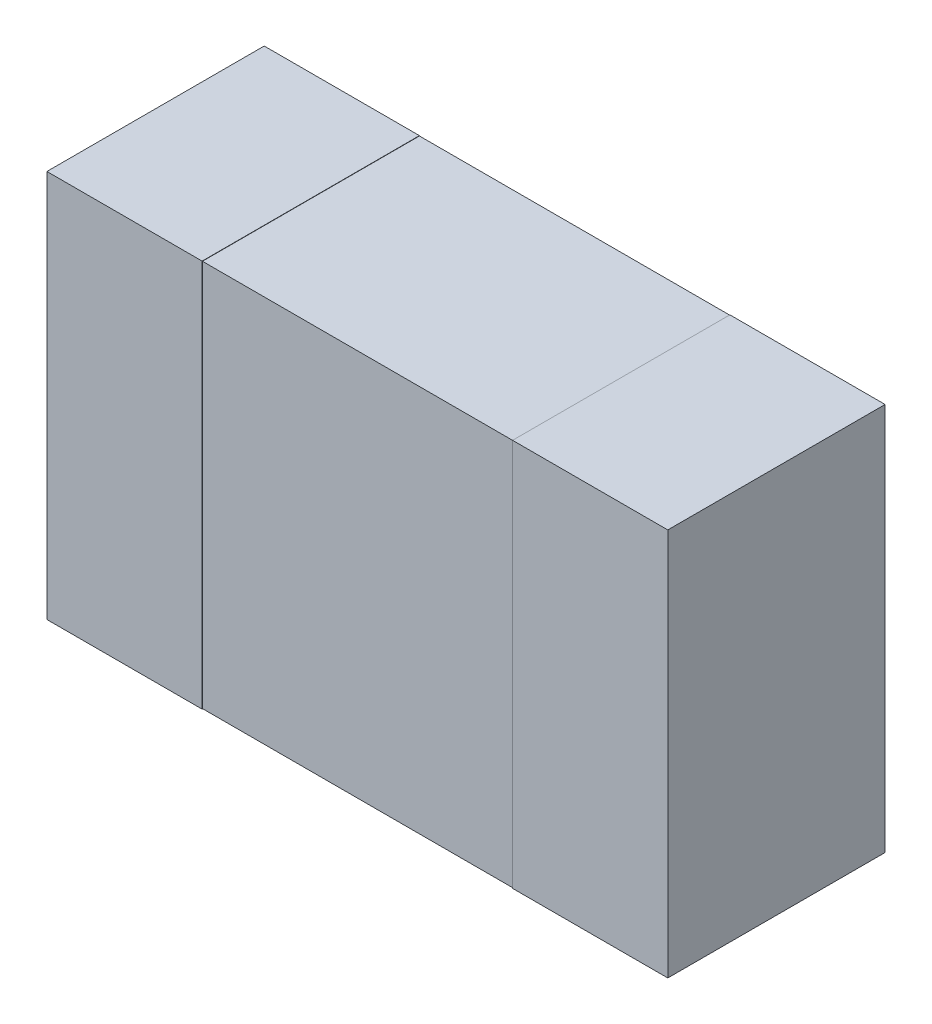
ISO-10303-21;
HEADER;
FILE_DESCRIPTION(('STEP AP214'),'2;1');
FILE_NAME('part.step','',(''),(''),'','','');
FILE_SCHEMA(('AUTOMOTIVE_DESIGN { 1 0 10303 214 1 1 1 1 }'));
ENDSEC;
DATA;
#1=APPLICATION_CONTEXT('core data for automotive mechanical design processes');
#2=APPLICATION_PROTOCOL_DEFINITION('international standard','automotive_design',2000,#1);
#3=PRODUCT_CONTEXT('',#1,'mechanical');
#4=PRODUCT('Part','Part','',(#3));
#5=PRODUCT_RELATED_PRODUCT_CATEGORY('part','',(#4));
#6=PRODUCT_DEFINITION_FORMATION('','',#4);
#7=PRODUCT_DEFINITION_CONTEXT('part definition',#1,'design');
#8=PRODUCT_DEFINITION('design','',#6,#7);
#9=PRODUCT_DEFINITION_SHAPE('','',#8);
#10=(LENGTH_UNIT() NAMED_UNIT(*) SI_UNIT(.MILLI.,.METRE.));
#11=(NAMED_UNIT(*) PLANE_ANGLE_UNIT() SI_UNIT($,.RADIAN.));
#12=(NAMED_UNIT(*) SI_UNIT($,.STERADIAN.) SOLID_ANGLE_UNIT());
#13=UNCERTAINTY_MEASURE_WITH_UNIT(LENGTH_MEASURE(1.E-05),#10,'distance_accuracy_value','');
#14=(GEOMETRIC_REPRESENTATION_CONTEXT(3) GLOBAL_UNCERTAINTY_ASSIGNED_CONTEXT((#13)) GLOBAL_UNIT_ASSIGNED_CONTEXT((#10,
#11,#12)) REPRESENTATION_CONTEXT('',''));
#15=CARTESIAN_POINT('',(0.,0.,0.));
#16=DIRECTION('',(0.,0.,1.));
#17=DIRECTION('',(1.,0.,0.));
#18=AXIS2_PLACEMENT_3D('',#15,#16,#17);
#19=CARTESIAN_POINT('',(0.5,-0.625,0.699));
#20=DIRECTION('',(0.,0.,-1.));
#21=DIRECTION('',(-1.,0.,0.));
#22=AXIS2_PLACEMENT_3D('',#19,#20,#21);
#23=PLANE('',#22);
#24=DIRECTION('',(0.,1.,0.));
#25=VECTOR('',#24,1.);
#26=CARTESIAN_POINT('',(0.5,-0.625,0.699));
#27=LINE('',#26,#25);
#28=CARTESIAN_POINT('',(0.5,-0.624,0.699));
#29=VERTEX_POINT('',#28);
#30=CARTESIAN_POINT('',(0.5,0.624,0.699));
#31=VERTEX_POINT('',#30);
#32=EDGE_CURVE('E197',#29,#31,#27,.T.);
#33=ORIENTED_EDGE('',*,*,#32,.T.);
#34=DIRECTION('',(-1.,0.,0.));
#35=VECTOR('',#34,1.);
#36=CARTESIAN_POINT('',(0.5,0.624,0.699));
#37=LINE('',#36,#35);
#38=CARTESIAN_POINT('',(-0.5,0.624,0.699));
#39=VERTEX_POINT('',#38);
#40=EDGE_CURVE('E242',#31,#39,#37,.T.);
#41=ORIENTED_EDGE('',*,*,#40,.T.);
#42=DIRECTION('',(0.,1.,0.));
#43=VECTOR('',#42,1.);
#44=CARTESIAN_POINT('',(-0.5,-0.625,0.699));
#45=LINE('',#44,#43);
#46=CARTESIAN_POINT('',(-0.5,-0.624,0.699));
#47=VERTEX_POINT('',#46);
#48=EDGE_CURVE('E193',#47,#39,#45,.T.);
#49=ORIENTED_EDGE('',*,*,#48,.F.);
#50=DIRECTION('',(-1.,0.,0.));
#51=VECTOR('',#50,1.);
#52=CARTESIAN_POINT('',(0.5,-0.624,0.699));
#53=LINE('',#52,#51);
#54=EDGE_CURVE('E11',#29,#47,#53,.T.);
#55=ORIENTED_EDGE('',*,*,#54,.F.);
#56=EDGE_LOOP('',(#33,#41,#49,#55));
#57=FACE_BOUND('',#56,.T.);
#58=ADVANCED_FACE('F18',(#57),#23,.F.);
#59=CARTESIAN_POINT('',(0.5,-0.624,0.7));
#60=DIRECTION('',(0.,1.,0.));
#61=DIRECTION('',(1.,0.,0.));
#62=AXIS2_PLACEMENT_3D('',#59,#60,#61);
#63=PLANE('',#62);
#64=DIRECTION('',(0.,0.,-1.));
#65=VECTOR('',#64,1.);
#66=CARTESIAN_POINT('',(0.5,-0.624,0.7));
#67=LINE('',#66,#65);
#68=CARTESIAN_POINT('',(0.5,-0.624,0.));
#69=VERTEX_POINT('',#68);
#70=EDGE_CURVE('E28',#29,#69,#67,.T.);
#71=ORIENTED_EDGE('',*,*,#70,.F.);
#72=ORIENTED_EDGE('',*,*,#54,.T.);
#73=DIRECTION('',(0.,0.,-1.));
#74=VECTOR('',#73,1.);
#75=CARTESIAN_POINT('',(-0.5,-0.624,0.7));
#76=LINE('',#75,#74);
#77=CARTESIAN_POINT('',(-0.5,-0.624,0.));
#78=VERTEX_POINT('',#77);
#79=EDGE_CURVE('E196',#47,#78,#76,.T.);
#80=ORIENTED_EDGE('',*,*,#79,.T.);
#81=DIRECTION('',(1.,0.,0.));
#82=VECTOR('',#81,1.);
#83=CARTESIAN_POINT('',(0.5,-0.624,0.));
#84=LINE('',#83,#82);
#85=EDGE_CURVE('E222',#78,#69,#84,.T.);
#86=ORIENTED_EDGE('',*,*,#85,.T.);
#87=EDGE_LOOP('',(#71,#72,#80,#86));
#88=FACE_BOUND('',#87,.T.);
#89=ADVANCED_FACE('F280',(#88),#63,.F.);
#90=CARTESIAN_POINT('',(0.5,0.625,0.7));
#91=DIRECTION('',(1.,-1.084202172485E-13,0.));
#92=DIRECTION('',(-1.084202172485E-13,-1.,0.));
#93=AXIS2_PLACEMENT_3D('',#90,#91,#92);
#94=PLANE('',#93);
#95=DIRECTION('',(-1.084202172485E-13,-1.,0.));
#96=VECTOR('',#95,1.);
#97=CARTESIAN_POINT('',(0.5,0.625,0.));
#98=LINE('',#97,#96);
#99=CARTESIAN_POINT('',(0.5,0.625,0.));
#100=VERTEX_POINT('',#99);
#101=CARTESIAN_POINT('',(0.5,0.624,0.));
#102=VERTEX_POINT('',#101);
#103=EDGE_CURVE('E204',#100,#102,#98,.T.);
#104=ORIENTED_EDGE('',*,*,#103,.T.);
#105=DIRECTION('',(0.,0.,-1.));
#106=VECTOR('',#105,1.);
#107=CARTESIAN_POINT('',(0.5,0.624,0.7));
#108=LINE('',#107,#106);
#109=EDGE_CURVE('E200',#31,#102,#108,.T.);
#110=ORIENTED_EDGE('',*,*,#109,.F.);
#111=ORIENTED_EDGE('',*,*,#32,.F.);
#112=ORIENTED_EDGE('',*,*,#70,.T.);
#113=DIRECTION('',(0.,-1.,0.));
#114=VECTOR('',#113,1.);
#115=CARTESIAN_POINT('',(0.5,-0.624,0.));
#116=LINE('',#115,#114);
#117=CARTESIAN_POINT('',(0.5,-0.625,0.));
#118=VERTEX_POINT('',#117);
#119=EDGE_CURVE('E201',#69,#118,#116,.T.);
#120=ORIENTED_EDGE('',*,*,#119,.T.);
#121=DIRECTION('',(0.,0.,-1.));
#122=VECTOR('',#121,1.);
#123=CARTESIAN_POINT('',(0.5,-0.625,0.7));
#124=LINE('',#123,#122);
#125=CARTESIAN_POINT('',(0.5,-0.625,0.7));
#126=VERTEX_POINT('',#125);
#127=EDGE_CURVE('E250',#126,#118,#124,.T.);
#128=ORIENTED_EDGE('',*,*,#127,.F.);
#129=DIRECTION('',(-1.084202172485E-13,-1.,0.));
#130=VECTOR('',#129,1.);
#131=CARTESIAN_POINT('',(0.5,0.625,0.7));
#132=LINE('',#131,#130);
#133=CARTESIAN_POINT('',(0.5,0.625,0.7));
#134=VERTEX_POINT('',#133);
#135=EDGE_CURVE('E226',#134,#126,#132,.T.);
#136=ORIENTED_EDGE('',*,*,#135,.F.);
#137=DIRECTION('',(0.,0.,-1.));
#138=VECTOR('',#137,1.);
#139=CARTESIAN_POINT('',(0.5,0.625,0.7));
#140=LINE('',#139,#138);
#141=EDGE_CURVE('E214',#134,#100,#140,.T.);
#142=ORIENTED_EDGE('',*,*,#141,.T.);
#143=EDGE_LOOP('',(#104,#110,#111,#112,#120,#128,#136,#142));
#144=FACE_BOUND('',#143,.T.);
#145=ADVANCED_FACE('F283',(#144),#94,.F.);
#146=CARTESIAN_POINT('',(0.5,0.624,0.7));
#147=DIRECTION('',(0.,-1.,0.));
#148=DIRECTION('',(0.,0.,-1.));
#149=AXIS2_PLACEMENT_3D('',#146,#147,#148);
#150=PLANE('',#149);
#151=DIRECTION('',(0.,0.,-1.));
#152=VECTOR('',#151,1.);
#153=CARTESIAN_POINT('',(-0.5,0.624,0.7));
#154=LINE('',#153,#152);
#155=CARTESIAN_POINT('',(-0.5,0.624,0.));
#156=VERTEX_POINT('',#155);
#157=EDGE_CURVE('E101',#39,#156,#154,.T.);
#158=ORIENTED_EDGE('',*,*,#157,.F.);
#159=ORIENTED_EDGE('',*,*,#40,.F.);
#160=ORIENTED_EDGE('',*,*,#109,.T.);
#161=DIRECTION('',(-1.,0.,0.));
#162=VECTOR('',#161,1.);
#163=CARTESIAN_POINT('',(0.5,0.624,0.));
#164=LINE('',#163,#162);
#165=EDGE_CURVE('E246',#102,#156,#164,.T.);
#166=ORIENTED_EDGE('',*,*,#165,.T.);
#167=EDGE_LOOP('',(#158,#159,#160,#166));
#168=FACE_BOUND('',#167,.T.);
#169=ADVANCED_FACE('F291',(#168),#150,.F.);
#170=CARTESIAN_POINT('',(-0.5,0.625,0.7));
#171=DIRECTION('',(-1.,-1.084202172485E-13,0.));
#172=DIRECTION('',(-1.084202172485E-13,1.,0.));
#173=AXIS2_PLACEMENT_3D('',#170,#171,#172);
#174=PLANE('',#173);
#175=DIRECTION('',(-1.084202172485E-13,1.,0.));
#176=VECTOR('',#175,1.);
#177=CARTESIAN_POINT('',(-0.5,0.625,0.));
#178=LINE('',#177,#176);
#179=CARTESIAN_POINT('',(-0.5,0.625,0.));
#180=VERTEX_POINT('',#179);
#181=EDGE_CURVE('E187',#156,#180,#178,.T.);
#182=ORIENTED_EDGE('',*,*,#181,.T.);
#183=DIRECTION('',(0.,0.,-1.));
#184=VECTOR('',#183,1.);
#185=CARTESIAN_POINT('',(-0.5,0.625,0.7));
#186=LINE('',#185,#184);
#187=CARTESIAN_POINT('',(-0.5,0.625,0.7));
#188=VERTEX_POINT('',#187);
#189=EDGE_CURVE('E169',#188,#180,#186,.T.);
#190=ORIENTED_EDGE('',*,*,#189,.F.);
#191=DIRECTION('',(-1.084202172485E-13,1.,0.));
#192=VECTOR('',#191,1.);
#193=CARTESIAN_POINT('',(-0.5,0.625,0.7));
#194=LINE('',#193,#192);
#195=CARTESIAN_POINT('',(-0.5,-0.625,0.7));
#196=VERTEX_POINT('',#195);
#197=EDGE_CURVE('E166',#196,#188,#194,.T.);
#198=ORIENTED_EDGE('',*,*,#197,.F.);
#199=DIRECTION('',(0.,0.,-1.));
#200=VECTOR('',#199,1.);
#201=CARTESIAN_POINT('',(-0.5,-0.625,0.7));
#202=LINE('',#201,#200);
#203=CARTESIAN_POINT('',(-0.5,-0.625,0.));
#204=VERTEX_POINT('',#203);
#205=EDGE_CURVE('E154',#196,#204,#202,.T.);
#206=ORIENTED_EDGE('',*,*,#205,.T.);
#207=DIRECTION('',(0.,1.,0.));
#208=VECTOR('',#207,1.);
#209=CARTESIAN_POINT('',(-0.5,-0.624,0.));
#210=LINE('',#209,#208);
#211=EDGE_CURVE('E225',#204,#78,#210,.T.);
#212=ORIENTED_EDGE('',*,*,#211,.T.);
#213=ORIENTED_EDGE('',*,*,#79,.F.);
#214=ORIENTED_EDGE('',*,*,#48,.T.);
#215=ORIENTED_EDGE('',*,*,#157,.T.);
#216=EDGE_LOOP('',(#182,#190,#198,#206,#212,#213,#214,#215));
#217=FACE_BOUND('',#216,.T.);
#218=ADVANCED_FACE('F167',(#217),#174,.F.);
#219=CARTESIAN_POINT('',(0.,0.,0.));
#220=DIRECTION('',(0.,0.,1.));
#221=DIRECTION('',(1.,0.,0.));
#222=AXIS2_PLACEMENT_3D('',#219,#220,#221);
#223=PLANE('',#222);
#224=ORIENTED_EDGE('',*,*,#85,.F.);
#225=ORIENTED_EDGE('',*,*,#211,.F.);
#226=DIRECTION('',(1.,0.,0.));
#227=VECTOR('',#226,1.);
#228=CARTESIAN_POINT('',(-1.,-0.625,0.));
#229=LINE('',#228,#227);
#230=CARTESIAN_POINT('',(-1.,-0.625,0.));
#231=VERTEX_POINT('',#230);
#232=EDGE_CURVE('E160',#231,#204,#229,.T.);
#233=ORIENTED_EDGE('',*,*,#232,.F.);
#234=DIRECTION('',(0.,-1.,0.));
#235=VECTOR('',#234,1.);
#236=CARTESIAN_POINT('',(-1.,0.625,0.));
#237=LINE('',#236,#235);
#238=CARTESIAN_POINT('',(-1.,0.625,0.));
#239=VERTEX_POINT('',#238);
#240=EDGE_CURVE('E126',#239,#231,#237,.T.);
#241=ORIENTED_EDGE('',*,*,#240,.F.);
#242=DIRECTION('',(-1.,0.,0.));
#243=VECTOR('',#242,1.);
#244=CARTESIAN_POINT('',(-1.,0.625,0.));
#245=LINE('',#244,#243);
#246=EDGE_CURVE('E21',#180,#239,#245,.T.);
#247=ORIENTED_EDGE('',*,*,#246,.F.);
#248=ORIENTED_EDGE('',*,*,#181,.F.);
#249=ORIENTED_EDGE('',*,*,#165,.F.);
#250=ORIENTED_EDGE('',*,*,#103,.F.);
#251=DIRECTION('',(-1.,0.,0.));
#252=VECTOR('',#251,1.);
#253=CARTESIAN_POINT('',(-1.,0.625,0.));
#254=LINE('',#253,#252);
#255=CARTESIAN_POINT('',(1.,0.625,0.));
#256=VERTEX_POINT('',#255);
#257=EDGE_CURVE('E218',#256,#100,#254,.T.);
#258=ORIENTED_EDGE('',*,*,#257,.F.);
#259=DIRECTION('',(0.,1.,0.));
#260=VECTOR('',#259,1.);
#261=CARTESIAN_POINT('',(1.,0.625,0.));
#262=LINE('',#261,#260);
#263=CARTESIAN_POINT('',(1.,-0.625,0.));
#264=VERTEX_POINT('',#263);
#265=EDGE_CURVE('E205',#264,#256,#262,.T.);
#266=ORIENTED_EDGE('',*,*,#265,.F.);
#267=DIRECTION('',(1.,0.,0.));
#268=VECTOR('',#267,1.);
#269=CARTESIAN_POINT('',(-1.,-0.625,0.));
#270=LINE('',#269,#268);
#271=EDGE_CURVE('E116',#118,#264,#270,.T.);
#272=ORIENTED_EDGE('',*,*,#271,.F.);
#273=ORIENTED_EDGE('',*,*,#119,.F.);
#274=EDGE_LOOP('',(#224,#225,#233,#241,#247,#248,#249,#250,#258,#266,#272,#273));
#275=FACE_BOUND('',#274,.T.);
#276=ADVANCED_FACE('F326',(#275),#223,.F.);
#277=CARTESIAN_POINT('',(0.,0.,0.7));
#278=DIRECTION('',(0.,0.,1.));
#279=DIRECTION('',(1.,0.,0.));
#280=AXIS2_PLACEMENT_3D('',#277,#278,#279);
#281=PLANE('',#280);
#282=ORIENTED_EDGE('',*,*,#135,.T.);
#283=DIRECTION('',(1.,0.,0.));
#284=VECTOR('',#283,1.);
#285=CARTESIAN_POINT('',(-1.,-0.625,0.7));
#286=LINE('',#285,#284);
#287=CARTESIAN_POINT('',(1.,-0.625,0.7));
#288=VERTEX_POINT('',#287);
#289=EDGE_CURVE('E191',#126,#288,#286,.T.);
#290=ORIENTED_EDGE('',*,*,#289,.T.);
#291=DIRECTION('',(0.,1.,0.));
#292=VECTOR('',#291,1.);
#293=CARTESIAN_POINT('',(1.,0.625,0.7));
#294=LINE('',#293,#292);
#295=CARTESIAN_POINT('',(1.,0.625,0.7));
#296=VERTEX_POINT('',#295);
#297=EDGE_CURVE('E219',#288,#296,#294,.T.);
#298=ORIENTED_EDGE('',*,*,#297,.T.);
#299=DIRECTION('',(-1.,0.,0.));
#300=VECTOR('',#299,1.);
#301=CARTESIAN_POINT('',(-1.,0.625,0.7));
#302=LINE('',#301,#300);
#303=EDGE_CURVE('E192',#296,#134,#302,.T.);
#304=ORIENTED_EDGE('',*,*,#303,.T.);
#305=EDGE_LOOP('',(#282,#290,#298,#304));
#306=FACE_BOUND('',#305,.T.);
#307=ADVANCED_FACE('F275',(#306),#281,.T.);
#308=CARTESIAN_POINT('',(-1.,-0.625,0.7));
#309=DIRECTION('',(0.,1.,0.));
#310=DIRECTION('',(1.,0.,0.));
#311=AXIS2_PLACEMENT_3D('',#308,#309,#310);
#312=PLANE('',#311);
#313=ORIENTED_EDGE('',*,*,#289,.F.);
#314=ORIENTED_EDGE('',*,*,#127,.T.);
#315=ORIENTED_EDGE('',*,*,#271,.T.);
#316=DIRECTION('',(0.,0.,-1.));
#317=VECTOR('',#316,1.);
#318=CARTESIAN_POINT('',(1.,-0.625,0.7));
#319=LINE('',#318,#317);
#320=EDGE_CURVE('E215',#288,#264,#319,.T.);
#321=ORIENTED_EDGE('',*,*,#320,.F.);
#322=EDGE_LOOP('',(#313,#314,#315,#321));
#323=FACE_BOUND('',#322,.T.);
#324=ADVANCED_FACE('F265',(#323),#312,.F.);
#325=CARTESIAN_POINT('',(-1.,0.625,0.7));
#326=DIRECTION('',(1.,0.,0.));
#327=DIRECTION('',(0.,1.,0.));
#328=AXIS2_PLACEMENT_3D('',#325,#326,#327);
#329=PLANE('',#328);
#330=ORIENTED_EDGE('',*,*,#240,.T.);
#331=DIRECTION('',(0.,0.,-1.));
#332=VECTOR('',#331,1.);
#333=CARTESIAN_POINT('',(-1.,-0.625,0.7));
#334=LINE('',#333,#332);
#335=CARTESIAN_POINT('',(-1.,-0.625,0.7));
#336=VERTEX_POINT('',#335);
#337=EDGE_CURVE('E163',#336,#231,#334,.T.);
#338=ORIENTED_EDGE('',*,*,#337,.F.);
#339=DIRECTION('',(0.,-1.,0.));
#340=VECTOR('',#339,1.);
#341=CARTESIAN_POINT('',(-1.,0.625,0.7));
#342=LINE('',#341,#340);
#343=CARTESIAN_POINT('',(-1.,0.625,0.7));
#344=VERTEX_POINT('',#343);
#345=EDGE_CURVE('E179',#344,#336,#342,.T.);
#346=ORIENTED_EDGE('',*,*,#345,.F.);
#347=DIRECTION('',(0.,0.,-1.));
#348=VECTOR('',#347,1.);
#349=CARTESIAN_POINT('',(-1.,0.625,0.7));
#350=LINE('',#349,#348);
#351=EDGE_CURVE('E210',#344,#239,#350,.T.);
#352=ORIENTED_EDGE('',*,*,#351,.T.);
#353=EDGE_LOOP('',(#330,#338,#346,#352));
#354=FACE_BOUND('',#353,.T.);
#355=ADVANCED_FACE('F259',(#354),#329,.F.);
#356=CARTESIAN_POINT('',(-1.,0.625,0.7));
#357=DIRECTION('',(0.,-1.,0.));
#358=DIRECTION('',(0.,0.,-1.));
#359=AXIS2_PLACEMENT_3D('',#356,#357,#358);
#360=PLANE('',#359);
#361=ORIENTED_EDGE('',*,*,#257,.T.);
#362=ORIENTED_EDGE('',*,*,#141,.F.);
#363=ORIENTED_EDGE('',*,*,#303,.F.);
#364=DIRECTION('',(0.,0.,-1.));
#365=VECTOR('',#364,1.);
#366=CARTESIAN_POINT('',(1.,0.625,0.7));
#367=LINE('',#366,#365);
#368=EDGE_CURVE('E209',#296,#256,#367,.T.);
#369=ORIENTED_EDGE('',*,*,#368,.T.);
#370=EDGE_LOOP('',(#361,#362,#363,#369));
#371=FACE_BOUND('',#370,.T.);
#372=ADVANCED_FACE('F264',(#371),#360,.F.);
#373=CARTESIAN_POINT('',(1.,0.625,0.7));
#374=DIRECTION('',(-1.,0.,0.));
#375=DIRECTION('',(0.,0.,1.));
#376=AXIS2_PLACEMENT_3D('',#373,#374,#375);
#377=PLANE('',#376);
#378=ORIENTED_EDGE('',*,*,#265,.T.);
#379=ORIENTED_EDGE('',*,*,#368,.F.);
#380=ORIENTED_EDGE('',*,*,#297,.F.);
#381=ORIENTED_EDGE('',*,*,#320,.T.);
#382=EDGE_LOOP('',(#378,#379,#380,#381));
#383=FACE_BOUND('',#382,.T.);
#384=ADVANCED_FACE('F272',(#383),#377,.F.);
#385=CARTESIAN_POINT('',(-1.,0.625,0.7));
#386=DIRECTION('',(0.,-1.,0.));
#387=DIRECTION('',(0.,0.,-1.));
#388=AXIS2_PLACEMENT_3D('',#385,#386,#387);
#389=PLANE('',#388);
#390=DIRECTION('',(-1.,0.,0.));
#391=VECTOR('',#390,1.);
#392=CARTESIAN_POINT('',(-1.,0.625,0.7));
#393=LINE('',#392,#391);
#394=EDGE_CURVE('E174',#188,#344,#393,.T.);
#395=ORIENTED_EDGE('',*,*,#394,.F.);
#396=ORIENTED_EDGE('',*,*,#189,.T.);
#397=ORIENTED_EDGE('',*,*,#246,.T.);
#398=ORIENTED_EDGE('',*,*,#351,.F.);
#399=EDGE_LOOP('',(#395,#396,#397,#398));
#400=FACE_BOUND('',#399,.T.);
#401=ADVANCED_FACE('F256',(#400),#389,.F.);
#402=CARTESIAN_POINT('',(-1.,-0.625,0.7));
#403=DIRECTION('',(0.,1.,0.));
#404=DIRECTION('',(1.,0.,0.));
#405=AXIS2_PLACEMENT_3D('',#402,#403,#404);
#406=PLANE('',#405);
#407=ORIENTED_EDGE('',*,*,#232,.T.);
#408=ORIENTED_EDGE('',*,*,#205,.F.);
#409=DIRECTION('',(1.,0.,0.));
#410=VECTOR('',#409,1.);
#411=CARTESIAN_POINT('',(-1.,-0.625,0.7));
#412=LINE('',#411,#410);
#413=EDGE_CURVE('E159',#336,#196,#412,.T.);
#414=ORIENTED_EDGE('',*,*,#413,.F.);
#415=ORIENTED_EDGE('',*,*,#337,.T.);
#416=EDGE_LOOP('',(#407,#408,#414,#415));
#417=FACE_BOUND('',#416,.T.);
#418=ADVANCED_FACE('F156',(#417),#406,.F.);
#419=CARTESIAN_POINT('',(0.,0.,0.7));
#420=DIRECTION('',(0.,0.,1.));
#421=DIRECTION('',(1.,0.,0.));
#422=AXIS2_PLACEMENT_3D('',#419,#420,#421);
#423=PLANE('',#422);
#424=ORIENTED_EDGE('',*,*,#413,.T.);
#425=ORIENTED_EDGE('',*,*,#197,.T.);
#426=ORIENTED_EDGE('',*,*,#394,.T.);
#427=ORIENTED_EDGE('',*,*,#345,.T.);
#428=EDGE_LOOP('',(#424,#425,#426,#427));
#429=FACE_BOUND('',#428,.T.);
#430=ADVANCED_FACE('F177',(#429),#423,.T.);
#431=CLOSED_SHELL('',(#58,#89,#145,#169,#218,#276,#307,#324,#355,#372,#384,#401,#418,#430));
#432=MANIFOLD_SOLID_BREP('B1',#431);
#433=ADVANCED_BREP_SHAPE_REPRESENTATION('',(#18,#432),#14);
#434=SHAPE_DEFINITION_REPRESENTATION(#9,#433);
ENDSEC;
END-ISO-10303-21;
